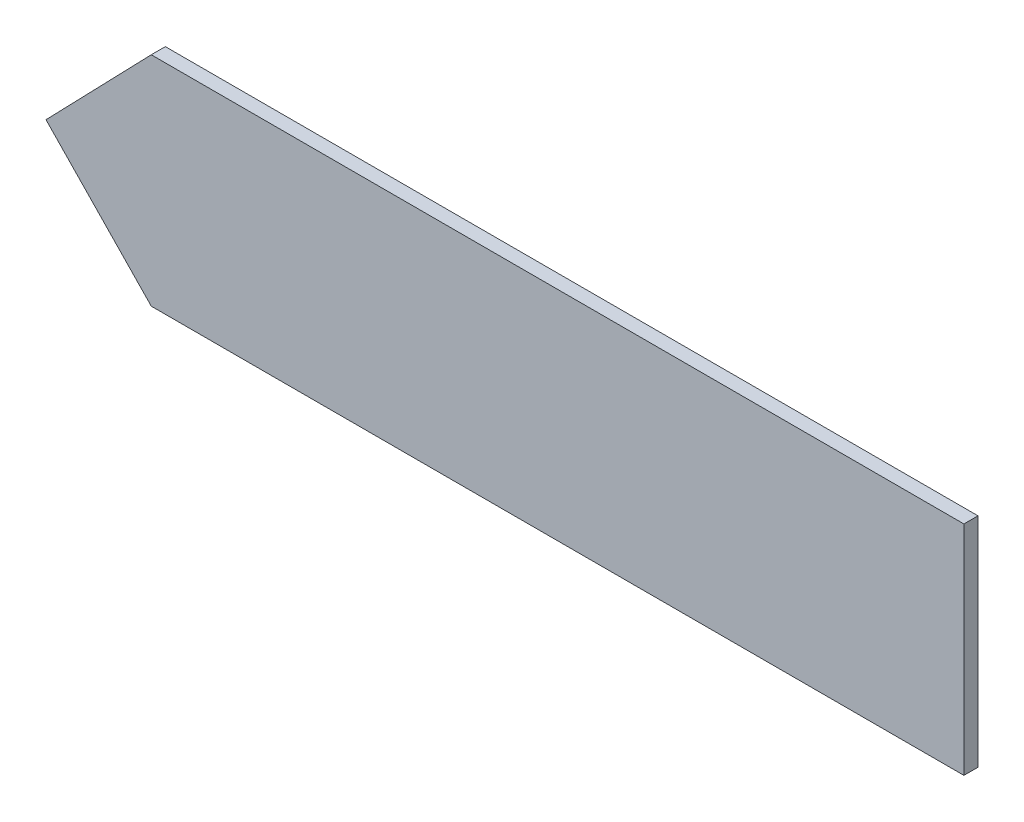
ISO-10303-21;
HEADER;
FILE_DESCRIPTION(('STEP AP214'),'2;1');
FILE_NAME('part.step','',(''),(''),'','','');
FILE_SCHEMA(('AUTOMOTIVE_DESIGN { 1 0 10303 214 1 1 1 1 }'));
ENDSEC;
DATA;
#1=APPLICATION_CONTEXT('core data for automotive mechanical design processes');
#2=APPLICATION_PROTOCOL_DEFINITION('international standard','automotive_design',2000,#1);
#3=PRODUCT_CONTEXT('',#1,'mechanical');
#4=PRODUCT('Part','Part','',(#3));
#5=PRODUCT_RELATED_PRODUCT_CATEGORY('part','',(#4));
#6=PRODUCT_DEFINITION_FORMATION('','',#4);
#7=PRODUCT_DEFINITION_CONTEXT('part definition',#1,'design');
#8=PRODUCT_DEFINITION('design','',#6,#7);
#9=PRODUCT_DEFINITION_SHAPE('','',#8);
#10=(LENGTH_UNIT() NAMED_UNIT(*) SI_UNIT(.MILLI.,.METRE.));
#11=(NAMED_UNIT(*) PLANE_ANGLE_UNIT() SI_UNIT($,.RADIAN.));
#12=(NAMED_UNIT(*) SI_UNIT($,.STERADIAN.) SOLID_ANGLE_UNIT());
#13=UNCERTAINTY_MEASURE_WITH_UNIT(LENGTH_MEASURE(1.E-05),#10,'distance_accuracy_value','');
#14=(GEOMETRIC_REPRESENTATION_CONTEXT(3) GLOBAL_UNCERTAINTY_ASSIGNED_CONTEXT((#13)) GLOBAL_UNIT_ASSIGNED_CONTEXT((#10,
#11,#12)) REPRESENTATION_CONTEXT('',''));
#15=CARTESIAN_POINT('',(0.,0.,0.));
#16=DIRECTION('',(0.,0.,1.));
#17=DIRECTION('',(1.,0.,0.));
#18=AXIS2_PLACEMENT_3D('',#15,#16,#17);
#19=CARTESIAN_POINT('',(0.,0.4415,-0.004575));
#20=DIRECTION('',(1.,0.,0.));
#21=DIRECTION('',(0.,1.,0.));
#22=AXIS2_PLACEMENT_3D('',#19,#20,#21);
#23=PLANE('',#22);
#24=DIRECTION('',(0.,0.,1.));
#25=VECTOR('',#24,1.);
#26=CARTESIAN_POINT('',(0.,0.4415,-0.004575));
#27=LINE('',#26,#25);
#28=CARTESIAN_POINT('',(0.,0.4415,-0.004575));
#29=VERTEX_POINT('',#28);
#30=CARTESIAN_POINT('',(0.,0.4415,0.004575));
#31=VERTEX_POINT('',#30);
#32=EDGE_CURVE('E35',#29,#31,#27,.T.);
#33=ORIENTED_EDGE('',*,*,#32,.T.);
#34=DIRECTION('',(0.,1.,0.));
#35=VECTOR('',#34,1.);
#36=CARTESIAN_POINT('',(0.,0.4415,0.004575));
#37=LINE('',#36,#35);
#38=CARTESIAN_POINT('',(0.,0.3,0.004575));
#39=VERTEX_POINT('',#38);
#40=EDGE_CURVE('E78',#39,#31,#37,.T.);
#41=ORIENTED_EDGE('',*,*,#40,.F.);
#42=DIRECTION('',(0.,0.,1.));
#43=VECTOR('',#42,1.);
#44=CARTESIAN_POINT('',(0.,0.3,-0.004575));
#45=LINE('',#44,#43);
#46=CARTESIAN_POINT('',(0.,0.3,-0.004575));
#47=VERTEX_POINT('',#46);
#48=EDGE_CURVE('E11',#47,#39,#45,.T.);
#49=ORIENTED_EDGE('',*,*,#48,.F.);
#50=DIRECTION('',(0.,1.,0.));
#51=VECTOR('',#50,1.);
#52=CARTESIAN_POINT('',(0.,0.4415,-0.004575));
#53=LINE('',#52,#51);
#54=EDGE_CURVE('E79',#47,#29,#53,.T.);
#55=ORIENTED_EDGE('',*,*,#54,.T.);
#56=EDGE_LOOP('',(#33,#41,#49,#55));
#57=FACE_BOUND('',#56,.T.);
#58=ADVANCED_FACE('F32',(#57),#23,.T.);
#59=CARTESIAN_POINT('',(-0.5281,0.3,-0.004575));
#60=DIRECTION('',(0.,-1.,0.));
#61=DIRECTION('',(0.,0.,-1.));
#62=AXIS2_PLACEMENT_3D('',#59,#60,#61);
#63=PLANE('',#62);
#64=ORIENTED_EDGE('',*,*,#48,.T.);
#65=DIRECTION('',(1.,0.,0.));
#66=VECTOR('',#65,1.);
#67=CARTESIAN_POINT('',(-0.5281,0.3,0.004575));
#68=LINE('',#67,#66);
#69=CARTESIAN_POINT('',(-0.5281,0.3,0.004575));
#70=VERTEX_POINT('',#69);
#71=EDGE_CURVE('E96',#70,#39,#68,.T.);
#72=ORIENTED_EDGE('',*,*,#71,.F.);
#73=DIRECTION('',(0.,0.,1.));
#74=VECTOR('',#73,1.);
#75=CARTESIAN_POINT('',(-0.5281,0.3,-0.004575));
#76=LINE('',#75,#74);
#77=CARTESIAN_POINT('',(-0.5281,0.3,-0.004575));
#78=VERTEX_POINT('',#77);
#79=EDGE_CURVE('E40',#78,#70,#76,.T.);
#80=ORIENTED_EDGE('',*,*,#79,.F.);
#81=DIRECTION('',(1.,0.,0.));
#82=VECTOR('',#81,1.);
#83=CARTESIAN_POINT('',(-0.5281,0.3,-0.004575));
#84=LINE('',#83,#82);
#85=EDGE_CURVE('E84',#78,#47,#84,.T.);
#86=ORIENTED_EDGE('',*,*,#85,.T.);
#87=EDGE_LOOP('',(#64,#72,#80,#86));
#88=FACE_BOUND('',#87,.T.);
#89=ADVANCED_FACE('F124',(#88),#63,.T.);
#90=CARTESIAN_POINT('',(-0.5965,0.37075,-0.004575));
#91=DIRECTION('',(-0.718946058279003,-0.695065871184224,0.));
#92=DIRECTION('',(0.695065871184224,-0.718946058279003,0.));
#93=AXIS2_PLACEMENT_3D('',#90,#91,#92);
#94=PLANE('',#93);
#95=ORIENTED_EDGE('',*,*,#79,.T.);
#96=DIRECTION('',(0.695065871184224,-0.718946058279003,0.));
#97=VECTOR('',#96,1.);
#98=CARTESIAN_POINT('',(-0.5965,0.37075,0.004575));
#99=LINE('',#98,#97);
#100=CARTESIAN_POINT('',(-0.5965,0.37075,0.004575));
#101=VERTEX_POINT('',#100);
#102=EDGE_CURVE('E100',#101,#70,#99,.T.);
#103=ORIENTED_EDGE('',*,*,#102,.F.);
#104=DIRECTION('',(0.,0.,1.));
#105=VECTOR('',#104,1.);
#106=CARTESIAN_POINT('',(-0.5965,0.37075,-0.004575));
#107=LINE('',#106,#105);
#108=CARTESIAN_POINT('',(-0.5965,0.37075,-0.004575));
#109=VERTEX_POINT('',#108);
#110=EDGE_CURVE('E113',#109,#101,#107,.T.);
#111=ORIENTED_EDGE('',*,*,#110,.F.);
#112=DIRECTION('',(0.695065871184224,-0.718946058279003,0.));
#113=VECTOR('',#112,1.);
#114=CARTESIAN_POINT('',(-0.5965,0.37075,-0.004575));
#115=LINE('',#114,#113);
#116=EDGE_CURVE('E109',#109,#78,#115,.T.);
#117=ORIENTED_EDGE('',*,*,#116,.T.);
#118=EDGE_LOOP('',(#95,#103,#111,#117));
#119=FACE_BOUND('',#118,.T.);
#120=ADVANCED_FACE('F120',(#119),#94,.T.);
#121=CARTESIAN_POINT('',(-0.5281,0.4415,-0.004575));
#122=DIRECTION('',(-0.718946058279003,0.695065871184224,0.));
#123=DIRECTION('',(-0.695065871184224,-0.718946058279003,0.));
#124=AXIS2_PLACEMENT_3D('',#121,#122,#123);
#125=PLANE('',#124);
#126=ORIENTED_EDGE('',*,*,#110,.T.);
#127=DIRECTION('',(-0.695065871184224,-0.718946058279003,0.));
#128=VECTOR('',#127,1.);
#129=CARTESIAN_POINT('',(-0.5281,0.4415,0.004575));
#130=LINE('',#129,#128);
#131=CARTESIAN_POINT('',(-0.5281,0.4415,0.004575));
#132=VERTEX_POINT('',#131);
#133=EDGE_CURVE('E91',#132,#101,#130,.T.);
#134=ORIENTED_EDGE('',*,*,#133,.F.);
#135=DIRECTION('',(0.,0.,1.));
#136=VECTOR('',#135,1.);
#137=CARTESIAN_POINT('',(-0.5281,0.4415,-0.004575));
#138=LINE('',#137,#136);
#139=CARTESIAN_POINT('',(-0.5281,0.4415,-0.004575));
#140=VERTEX_POINT('',#139);
#141=EDGE_CURVE('E83',#140,#132,#138,.T.);
#142=ORIENTED_EDGE('',*,*,#141,.F.);
#143=DIRECTION('',(-0.695065871184224,-0.718946058279003,0.));
#144=VECTOR('',#143,1.);
#145=CARTESIAN_POINT('',(-0.5281,0.4415,-0.004575));
#146=LINE('',#145,#144);
#147=EDGE_CURVE('E106',#140,#109,#146,.T.);
#148=ORIENTED_EDGE('',*,*,#147,.T.);
#149=EDGE_LOOP('',(#126,#134,#142,#148));
#150=FACE_BOUND('',#149,.T.);
#151=ADVANCED_FACE('F115',(#150),#125,.T.);
#152=CARTESIAN_POINT('',(-0.5281,0.4415,-0.004575));
#153=DIRECTION('',(0.,1.,0.));
#154=DIRECTION('',(0.,0.,1.));
#155=AXIS2_PLACEMENT_3D('',#152,#153,#154);
#156=PLANE('',#155);
#157=ORIENTED_EDGE('',*,*,#141,.T.);
#158=DIRECTION('',(-1.,0.,0.));
#159=VECTOR('',#158,1.);
#160=CARTESIAN_POINT('',(-0.5281,0.4415,0.004575));
#161=LINE('',#160,#159);
#162=EDGE_CURVE('E86',#31,#132,#161,.T.);
#163=ORIENTED_EDGE('',*,*,#162,.F.);
#164=ORIENTED_EDGE('',*,*,#32,.F.);
#165=DIRECTION('',(-1.,0.,0.));
#166=VECTOR('',#165,1.);
#167=CARTESIAN_POINT('',(-0.5281,0.4415,-0.004575));
#168=LINE('',#167,#166);
#169=EDGE_CURVE('E104',#29,#140,#168,.T.);
#170=ORIENTED_EDGE('',*,*,#169,.T.);
#171=EDGE_LOOP('',(#157,#163,#164,#170));
#172=FACE_BOUND('',#171,.T.);
#173=ADVANCED_FACE('F87',(#172),#156,.T.);
#174=CARTESIAN_POINT('',(-0.29825,0.37075,-0.004575));
#175=DIRECTION('',(0.,0.,1.));
#176=DIRECTION('',(1.,0.,0.));
#177=AXIS2_PLACEMENT_3D('',#174,#175,#176);
#178=PLANE('',#177);
#179=ORIENTED_EDGE('',*,*,#54,.F.);
#180=ORIENTED_EDGE('',*,*,#85,.F.);
#181=ORIENTED_EDGE('',*,*,#116,.F.);
#182=ORIENTED_EDGE('',*,*,#147,.F.);
#183=ORIENTED_EDGE('',*,*,#169,.F.);
#184=EDGE_LOOP('',(#179,#180,#181,#182,#183));
#185=FACE_BOUND('',#184,.T.);
#186=ADVANCED_FACE('F123',(#185),#178,.F.);
#187=CARTESIAN_POINT('',(-0.29825,0.37075,0.004575));
#188=DIRECTION('',(0.,0.,1.));
#189=DIRECTION('',(1.,0.,0.));
#190=AXIS2_PLACEMENT_3D('',#187,#188,#189);
#191=PLANE('',#190);
#192=ORIENTED_EDGE('',*,*,#40,.T.);
#193=ORIENTED_EDGE('',*,*,#162,.T.);
#194=ORIENTED_EDGE('',*,*,#133,.T.);
#195=ORIENTED_EDGE('',*,*,#102,.T.);
#196=ORIENTED_EDGE('',*,*,#71,.T.);
#197=EDGE_LOOP('',(#192,#193,#194,#195,#196));
#198=FACE_BOUND('',#197,.T.);
#199=ADVANCED_FACE('F94',(#198),#191,.T.);
#200=CLOSED_SHELL('',(#58,#89,#120,#151,#173,#186,#199));
#201=MANIFOLD_SOLID_BREP('B2',#200);
#202=ADVANCED_BREP_SHAPE_REPRESENTATION('',(#18,#201),#14);
#203=SHAPE_DEFINITION_REPRESENTATION(#9,#202);
ENDSEC;
END-ISO-10303-21;
